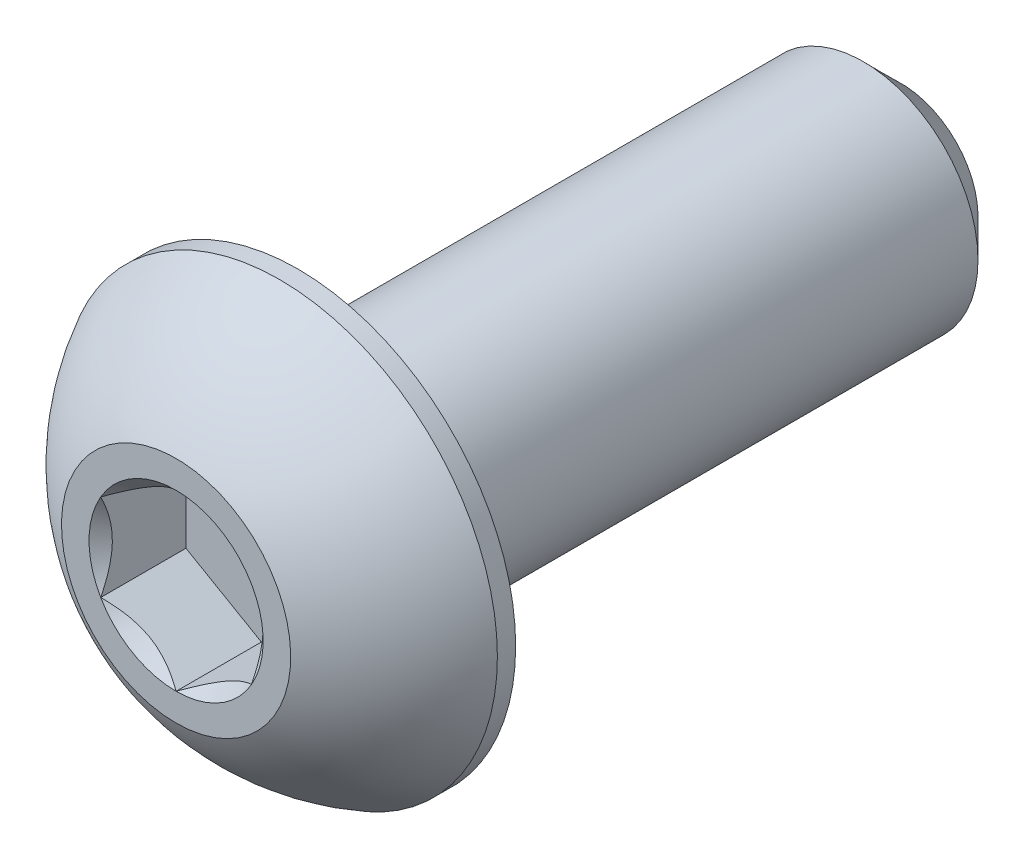
ISO-10303-21;
HEADER;
FILE_DESCRIPTION(('STEP AP214'),'2;1');
FILE_NAME('part.step','',(''),(''),'','','');
FILE_SCHEMA(('AUTOMOTIVE_DESIGN { 1 0 10303 214 1 1 1 1 }'));
ENDSEC;
DATA;
#1=APPLICATION_CONTEXT('core data for automotive mechanical design processes');
#2=APPLICATION_PROTOCOL_DEFINITION('international standard','automotive_design',2000,#1);
#3=PRODUCT_CONTEXT('',#1,'mechanical');
#4=PRODUCT('Part','Part','',(#3));
#5=PRODUCT_RELATED_PRODUCT_CATEGORY('part','',(#4));
#6=PRODUCT_DEFINITION_FORMATION('','',#4);
#7=PRODUCT_DEFINITION_CONTEXT('part definition',#1,'design');
#8=PRODUCT_DEFINITION('design','',#6,#7);
#9=PRODUCT_DEFINITION_SHAPE('','',#8);
#10=(LENGTH_UNIT() NAMED_UNIT(*) SI_UNIT(.MILLI.,.METRE.));
#11=(NAMED_UNIT(*) PLANE_ANGLE_UNIT() SI_UNIT($,.RADIAN.));
#12=(NAMED_UNIT(*) SI_UNIT($,.STERADIAN.) SOLID_ANGLE_UNIT());
#13=UNCERTAINTY_MEASURE_WITH_UNIT(LENGTH_MEASURE(1.E-05),#10,'distance_accuracy_value','');
#14=(GEOMETRIC_REPRESENTATION_CONTEXT(3) GLOBAL_UNCERTAINTY_ASSIGNED_CONTEXT((#13)) GLOBAL_UNIT_ASSIGNED_CONTEXT((#10,
#11,#12)) REPRESENTATION_CONTEXT('',''));
#15=CARTESIAN_POINT('',(0.,0.,0.));
#16=DIRECTION('',(0.,0.,1.));
#17=DIRECTION('',(1.,0.,0.));
#18=AXIS2_PLACEMENT_3D('',#15,#16,#17);
#19=CARTESIAN_POINT('',(0.,-2.41300000000001,-15.2654));
#20=DIRECTION('',(0.,0.,-1.));
#21=DIRECTION('',(0.,1.,0.));
#22=AXIS2_PLACEMENT_3D('',#19,#20,#21);
#23=PLANE('',#22);
#24=CARTESIAN_POINT('',(0.,0.,-15.2654));
#25=DIRECTION('',(0.,0.,-1.));
#26=DIRECTION('',(0.,1.,0.));
#27=AXIS2_PLACEMENT_3D('',#24,#25,#26);
#28=CIRCLE('',#27,1.61925000000001);
#29=CARTESIAN_POINT('',(0.,-1.61925000000001,-15.2654));
#30=VERTEX_POINT('',#29);
#31=EDGE_CURVE('E43',#30,#30,#28,.T.);
#32=ORIENTED_EDGE('',*,*,#31,.T.);
#33=EDGE_LOOP('',(#32));
#34=FACE_BOUND('',#33,.T.);
#35=ADVANCED_FACE('F35',(#34),#23,.T.);
#36=CARTESIAN_POINT('',(0.,0.,-15.2654));
#37=DIRECTION('',(0.,0.,-1.));
#38=DIRECTION('',(0.,1.,0.));
#39=AXIS2_PLACEMENT_3D('',#36,#37,#38);
#40=CYLINDRICAL_SURFACE('',#39,2.413);
#41=CARTESIAN_POINT('',(0.,0.,-14.47165));
#42=DIRECTION('',(0.,0.,-1.));
#43=DIRECTION('',(0.,1.,0.));
#44=AXIS2_PLACEMENT_3D('',#41,#42,#43);
#45=CIRCLE('',#44,2.413);
#46=CARTESIAN_POINT('',(0.,-2.41300000000001,-14.47165));
#47=VERTEX_POINT('',#46);
#48=EDGE_CURVE('E11',#47,#47,#45,.F.);
#49=ORIENTED_EDGE('',*,*,#48,.T.);
#50=EDGE_LOOP('',(#49));
#51=FACE_BOUND('',#50,.T.);
#52=CARTESIAN_POINT('',(0.,0.,-2.5654));
#53=DIRECTION('',(0.,0.,1.));
#54=DIRECTION('',(1.,0.,0.));
#55=AXIS2_PLACEMENT_3D('',#52,#53,#54);
#56=CIRCLE('',#55,2.413);
#57=CARTESIAN_POINT('',(2.413,0.,-2.5654));
#58=VERTEX_POINT('',#57);
#59=EDGE_CURVE('E169',#58,#58,#56,.F.);
#60=ORIENTED_EDGE('',*,*,#59,.T.);
#61=EDGE_LOOP('',(#60));
#62=FACE_BOUND('',#61,.T.);
#63=ADVANCED_FACE('F177',(#51,#62),#40,.T.);
#64=CARTESIAN_POINT('',(0.,0.,-15.2654));
#65=DIRECTION('',(0.,0.,1.));
#66=DIRECTION('',(0.,-1.,0.));
#67=AXIS2_PLACEMENT_3D('',#64,#65,#66);
#68=CONICAL_SURFACE('',#67,1.61925000000001,0.785398163397445);
#69=CARTESIAN_POINT('',(0.,-2.41300000000001,-14.47165));
#70=CARTESIAN_POINT('',(0.,-2.40473177083334,-14.4799182291667));
#71=CARTESIAN_POINT('',(0.,-2.39646354166667,-14.4881864583333));
#72=CARTESIAN_POINT('',(0.,-2.37992708333334,-14.5047229166667));
#73=CARTESIAN_POINT('',(0.,-2.37165885416667,-14.5129911458333));
#74=CARTESIAN_POINT('',(0.,-2.35512239583334,-14.5295276041667));
#75=CARTESIAN_POINT('',(0.,-2.34685416666667,-14.5377958333333));
#76=CARTESIAN_POINT('',(0.,-2.33031770833334,-14.5543322916667));
#77=CARTESIAN_POINT('',(0.,-2.32204947916667,-14.5626005208333));
#78=CARTESIAN_POINT('',(0.,-2.30551302083334,-14.5791369791667));
#79=CARTESIAN_POINT('',(0.,-2.29724479166667,-14.5874052083333));
#80=CARTESIAN_POINT('',(0.,-2.28070833333334,-14.6039416666667));
#81=CARTESIAN_POINT('',(0.,-2.27244010416667,-14.6122098958333));
#82=CARTESIAN_POINT('',(0.,-2.25590364583334,-14.6287463541667));
#83=CARTESIAN_POINT('',(0.,-2.24763541666667,-14.6370145833333));
#84=CARTESIAN_POINT('',(0.,-2.23109895833334,-14.6535510416667));
#85=CARTESIAN_POINT('',(0.,-2.22283072916667,-14.6618192708333));
#86=CARTESIAN_POINT('',(0.,-2.20629427083334,-14.6783557291667));
#87=CARTESIAN_POINT('',(0.,-2.19802604166667,-14.6866239583333));
#88=CARTESIAN_POINT('',(0.,-2.18148958333334,-14.7031604166667));
#89=CARTESIAN_POINT('',(0.,-2.17322135416667,-14.7114286458333));
#90=CARTESIAN_POINT('',(0.,-2.15668489583334,-14.7279651041667));
#91=CARTESIAN_POINT('',(0.,-2.14841666666667,-14.7362333333333));
#92=CARTESIAN_POINT('',(0.,-2.13188020833334,-14.7527697916667));
#93=CARTESIAN_POINT('',(0.,-2.12361197916667,-14.7610380208333));
#94=CARTESIAN_POINT('',(0.,-2.10707552083334,-14.7775744791667));
#95=CARTESIAN_POINT('',(0.,-2.09880729166667,-14.7858427083333));
#96=CARTESIAN_POINT('',(0.,-2.08227083333334,-14.8023791666667));
#97=CARTESIAN_POINT('',(0.,-2.07400260416667,-14.8106473958333));
#98=CARTESIAN_POINT('',(0.,-2.05746614583334,-14.8271838541667));
#99=CARTESIAN_POINT('',(0.,-2.04919791666667,-14.8354520833333));
#100=CARTESIAN_POINT('',(0.,-2.03266145833334,-14.8519885416667));
#101=CARTESIAN_POINT('',(0.,-2.02439322916667,-14.8602567708333));
#102=CARTESIAN_POINT('',(0.,-2.00785677083334,-14.8767932291667));
#103=CARTESIAN_POINT('',(0.,-1.99958854166668,-14.8850614583333));
#104=CARTESIAN_POINT('',(0.,-1.98305208333334,-14.9015979166667));
#105=CARTESIAN_POINT('',(0.,-1.97478385416667,-14.9098661458333));
#106=CARTESIAN_POINT('',(0.,-1.95824739583334,-14.9264026041667));
#107=CARTESIAN_POINT('',(0.,-1.94997916666668,-14.9346708333333));
#108=CARTESIAN_POINT('',(0.,-1.93344270833334,-14.9512072916667));
#109=CARTESIAN_POINT('',(0.,-1.92517447916668,-14.9594755208333));
#110=CARTESIAN_POINT('',(0.,-1.90863802083334,-14.9760119791667));
#111=CARTESIAN_POINT('',(0.,-1.90036979166668,-14.9842802083333));
#112=CARTESIAN_POINT('',(0.,-1.88383333333334,-15.0008166666667));
#113=CARTESIAN_POINT('',(0.,-1.87556510416668,-15.0090848958333));
#114=CARTESIAN_POINT('',(0.,-1.85902864583334,-15.0256213541667));
#115=CARTESIAN_POINT('',(0.,-1.85076041666668,-15.0338895833333));
#116=CARTESIAN_POINT('',(0.,-1.83422395833334,-15.0504260416667));
#117=CARTESIAN_POINT('',(0.,-1.82595572916668,-15.0586942708333));
#118=CARTESIAN_POINT('',(0.,-1.80941927083334,-15.0752307291667));
#119=CARTESIAN_POINT('',(0.,-1.80115104166668,-15.0834989583333));
#120=CARTESIAN_POINT('',(0.,-1.78461458333334,-15.1000354166667));
#121=CARTESIAN_POINT('',(0.,-1.77634635416668,-15.1083036458333));
#122=CARTESIAN_POINT('',(0.,-1.75980989583334,-15.1248401041667));
#123=CARTESIAN_POINT('',(0.,-1.75154166666668,-15.1331083333333));
#124=CARTESIAN_POINT('',(0.,-1.73500520833334,-15.1496447916667));
#125=CARTESIAN_POINT('',(0.,-1.72673697916668,-15.1579130208333));
#126=CARTESIAN_POINT('',(0.,-1.71020052083334,-15.1744494791667));
#127=CARTESIAN_POINT('',(0.,-1.70193229166668,-15.1827177083333));
#128=CARTESIAN_POINT('',(0.,-1.68539583333334,-15.1992541666667));
#129=CARTESIAN_POINT('',(0.,-1.67712760416668,-15.2075223958333));
#130=CARTESIAN_POINT('',(0.,-1.66059114583334,-15.2240588541667));
#131=CARTESIAN_POINT('',(0.,-1.65232291666668,-15.2323270833333));
#132=CARTESIAN_POINT('',(0.,-1.63578645833334,-15.2488635416667));
#133=CARTESIAN_POINT('',(0.,-1.62751822916668,-15.2571317708333));
#134=CARTESIAN_POINT('',(0.,-1.61925000000001,-15.2654));
#135=B_SPLINE_CURVE_WITH_KNOTS('',3,(#69,#70,#71,#72,#73,#74,#75,#76,#77,#78,#79,#80,#81,#82,
#83,#84,#85,#86,#87,#88,#89,#90,#91,#92,#93,#94,#95,#96,#97,#98,#99,#100,#101,#102,#103,#104,
#105,#106,#107,#108,#109,#110,#111,#112,#113,#114,#115,#116,#117,#118,#119,#120,#121,#122,#123,
#124,#125,#126,#127,#128,#129,#130,#131,#132,#133,#134),.UNSPECIFIED.,.F.,.F.,(4,2,2,2,2,2,2,2,
2,2,2,2,2,2,2,2,2,2,2,2,2,2,2,2,2,2,2,2,2,2,2,2,4),(0.,0.0350791254729259,0.0701582509458518,
0.105237376418779,0.140316501891705,0.175395627364631,0.210474752837558,0.245553878310484,
0.280633003783411,0.315712129256337,0.350791254729263,0.38587038020219,0.420949505675116,
0.456028631148042,0.491107756620969,0.526186882093895,0.561266007566822,0.596345133039748,
0.631424258512674,0.666503383985601,0.701582509458527,0.736661634931453,0.771740760404381,
0.806819885877306,0.841899011350234,0.87697813682316,0.912057262296086,0.947136387769013,
0.982215513241939,1.01729463871486,1.05237376418779,1.08745288966072,1.12253201513364),.UNSPECIFIED.);
#136=EDGE_CURVE('BSEAM37',#47,#30,#135,.T.);
#137=ORIENTED_EDGE('',*,*,#48,.F.);
#138=ORIENTED_EDGE('',*,*,#31,.F.);
#139=ORIENTED_EDGE('',*,*,#136,.T.);
#140=ORIENTED_EDGE('',*,*,#136,.F.);
#141=EDGE_LOOP('',(#137,#139,#138,#140));
#142=FACE_BOUND('',#141,.T.);
#143=ADVANCED_FACE('F37',(#142),#68,.T.);
#144=CARTESIAN_POINT('',(0.,0.,-4.5748806144438));
#145=DIRECTION('',(0.,0.,1.));
#146=DIRECTION('',(0.,-1.,0.));
#147=AXIS2_PLACEMENT_3D('',#144,#145,#146);
#148=SPHERICAL_SURFACE('',#147,5.17224338526463);
#149=CARTESIAN_POINT('',(0.,0.,0.));
#150=DIRECTION('',(0.,0.,1.));
#151=DIRECTION('',(1.,0.,0.));
#152=AXIS2_PLACEMENT_3D('',#149,#150,#151);
#153=CIRCLE('',#152,2.413);
#154=CARTESIAN_POINT('',(0.,-2.413,0.));
#155=VERTEX_POINT('',#154);
#156=EDGE_CURVE('E166',#155,#155,#153,.T.);
#157=CARTESIAN_POINT('',(0.,0.,-2.18059));
#158=DIRECTION('',(0.,0.,1.));
#159=DIRECTION('',(1.,0.,0.));
#160=AXIS2_PLACEMENT_3D('',#157,#158,#159);
#161=CIRCLE('',#160,4.5847);
#162=CARTESIAN_POINT('',(0.,-4.5847,-2.18059));
#163=VERTEX_POINT('',#162);
#164=EDGE_CURVE('E160',#163,#163,#161,.T.);
#165=CARTESIAN_POINT('',(0.,-2.413,0.));
#166=CARTESIAN_POINT('',(0.,-2.44179113663083,-0.0151857097788009));
#167=CARTESIAN_POINT('',(0.,-2.47043888331474,-0.0306432741933343));
#168=CARTESIAN_POINT('',(0.,-2.5274374690351,-0.0620964513369402));
#169=CARTESIAN_POINT('',(0.,-2.55578830807155,-0.0780920640660127));
#170=CARTESIAN_POINT('',(0.,-2.61218295074331,-0.110615676881771));
#171=CARTESIAN_POINT('',(0.,-2.64022675437863,-0.127143676968457));
#172=CARTESIAN_POINT('',(0.,-2.69599733629138,-0.160726162390165));
#173=CARTESIAN_POINT('',(0.,-2.72372411456882,-0.177780647725188));
#174=CARTESIAN_POINT('',(0.,-2.77885076121154,-0.21241002764294));
#175=CARTESIAN_POINT('',(0.,-2.80625062957682,-0.229984922225668));
#176=CARTESIAN_POINT('',(0.,-2.86071369040082,-0.265648855453746));
#177=CARTESIAN_POINT('',(0.,-2.88777688285954,-0.283737894099096));
#178=CARTESIAN_POINT('',(0.,-2.94155694533546,-0.320423667994127));
#179=CARTESIAN_POINT('',(0.,-2.96827381535265,-0.339020403243808));
#180=CARTESIAN_POINT('',(0.,-3.02135171000009,-0.37671494166065));
#181=CARTESIAN_POINT('',(0.,-3.04771273463033,-0.39581274482781));
#182=CARTESIAN_POINT('',(0.,-3.10006954235699,-0.434502611862808));
#183=CARTESIAN_POINT('',(0.,-3.12606532545341,-0.454094675730644));
#184=CARTESIAN_POINT('',(0.,-3.17768238416296,-0.493766080756604));
#185=CARTESIAN_POINT('',(0.,-3.20330365977609,-0.513845421914727));
#186=CARTESIAN_POINT('',(0.,-3.25416257105645,-0.554484224430573));
#187=CARTESIAN_POINT('',(0.,-3.27940020672367,-0.575043685788297));
#188=CARTESIAN_POINT('',(0.,-3.32948284239517,-0.616635400476975));
#189=CARTESIAN_POINT('',(0.,-3.35432784239946,-0.63766765380793));
#190=CARTESIAN_POINT('',(0.,-3.40361635097913,-0.680197455694829));
#191=CARTESIAN_POINT('',(0.,-3.42805985955453,-0.701695004250773));
#192=CARTESIAN_POINT('',(0.,-3.47653667261836,-0.745147733989217));
#193=CARTESIAN_POINT('',(0.,-3.5005699771068,-0.767102915171716));
#194=CARTESIAN_POINT('',(0.,-3.54821781555203,-0.81146308444603));
#195=CARTESIAN_POINT('',(0.,-3.57183234950881,-0.833868072537843));
#196=CARTESIAN_POINT('',(0.,-3.61863422971284,-0.879119869584105));
#197=CARTESIAN_POINT('',(0.,-3.64182157596008,-0.901966678538555));
#198=CARTESIAN_POINT('',(0.,-3.68776081583415,-0.948093973780533));
#199=CARTESIAN_POINT('',(0.,-3.71051270946098,-0.971374460068061));
#200=CARTESIAN_POINT('',(0.,-3.75557293439636,-1.01836081186645));
#201=CARTESIAN_POINT('',(0.,-3.7778812657049,-1.0420666773773));
#202=CARTESIAN_POINT('',(0.,-3.82204641440941,-1.08989533789018));
#203=CARTESIAN_POINT('',(0.,-3.84390323180538,-1.11401813289221));
#204=CARTESIAN_POINT('',(0.,-3.88715756202836,-1.16267205404467));
#205=CARTESIAN_POINT('',(0.,-3.90855507485536,-1.18720318019511));
#206=CARTESIAN_POINT('',(0.,-3.95088316899876,-1.23666501975588));
#207=CARTESIAN_POINT('',(0.,-3.97181375031515,-1.26159573316622));
#208=CARTESIAN_POINT('',(0.,-4.01320052092912,-1.31184786092909));
#209=CARTESIAN_POINT('',(0.,-4.03365671022669,-1.33716927528163));
#210=CARTESIAN_POINT('',(0.,-4.07408740538699,-1.38819377934977));
#211=CARTESIAN_POINT('',(0.,-4.09406191124973,-1.41389686906536));
#212=CARTESIAN_POINT('',(0.,-4.13352211981722,-1.46567556223513));
#213=CARTESIAN_POINT('',(0.,-4.15300782252198,-1.4917511656893));
#214=CARTESIAN_POINT('',(0.,-4.19148347927457,-1.54426559193551));
#215=CARTESIAN_POINT('',(0.,-4.2104734333224,-1.57070441472756));
#216=CARTESIAN_POINT('',(0.,-4.24795082398615,-1.6239358557723));
#217=CARTESIAN_POINT('',(0.,-4.26643826060207,-1.65072847402499));
#218=CARTESIAN_POINT('',(0.,-4.3029040266735,-1.70465795604563));
#219=CARTESIAN_POINT('',(0.,-4.32088235612901,-1.73179481981358));
#220=CARTESIAN_POINT('',(0.,-4.35632349988304,-1.78640312007115));
#221=CARTESIAN_POINT('',(0.,-4.37378631418156,-1.81387455656079));
#222=CARTESIAN_POINT('',(0.,-4.40819020238474,-1.86914221075438));
#223=CARTESIAN_POINT('',(0.,-4.42513127628939,-1.89693842845834));
#224=CARTESIAN_POINT('',(0.,-4.45848564813517,-1.95284573578717));
#225=CARTESIAN_POINT('',(0.,-4.4748989460763,-1.98095682541204));
#226=CARTESIAN_POINT('',(0.,-4.50719190474587,-2.03748386259807));
#227=CARTESIAN_POINT('',(0.,-4.5230715654743,-2.06589981015923));
#228=CARTESIAN_POINT('',(0.,-4.55429163018258,-2.12302641242262));
#229=CARTESIAN_POINT('',(0.,-4.56963203416241,-2.15173706712485));
#230=CARTESIAN_POINT('',(0.,-4.5847,-2.18059));
#231=B_SPLINE_CURVE_WITH_KNOTS('',3,(#165,#166,#167,#168,#169,#170,#171,#172,#173,#174,#175,
#176,#177,#178,#179,#180,#181,#182,#183,#184,#185,#186,#187,#188,#189,#190,#191,#192,#193,#194,
#195,#196,#197,#198,#199,#200,#201,#202,#203,#204,#205,#206,#207,#208,#209,#210,#211,#212,#213,
#214,#215,#216,#217,#218,#219,#220,#221,#222,#223,#224,#225,#226,#227,#228,#229,#230),
.UNSPECIFIED.,.F.,.F.,(4,2,2,2,2,2,2,2,2,2,2,2,2,2,2,2,2,2,2,2,2,2,2,2,2,2,2,2,2,2,2,2,4),(0.,
0.0976500604051489,0.195300120810298,0.292950181215447,0.390600241620598,0.488250302025747,
0.585900362430896,0.683550422836046,0.781200483241194,0.878850543646344,0.976500604051493,
1.07415066445664,1.17180072486179,1.26945078526694,1.36710084567209,1.46475090607724,
1.56240096648239,1.66005102688754,1.75770108729269,1.85535114769784,1.95300120810299,
2.05065126850814,2.14830132891329,2.24595138931843,2.34360144972358,2.44125151012873,
2.53890157053388,2.63655163093903,2.73420169134418,2.83185175174933,2.92950181215448,
3.02715187255963,3.12480193296478),.UNSPECIFIED.);
#232=EDGE_CURVE('BSEAM176',#155,#163,#231,.T.);
#233=ORIENTED_EDGE('',*,*,#156,.F.);
#234=ORIENTED_EDGE('',*,*,#164,.T.);
#235=ORIENTED_EDGE('',*,*,#232,.T.);
#236=ORIENTED_EDGE('',*,*,#232,.F.);
#237=EDGE_LOOP('',(#233,#235,#234,#236));
#238=FACE_BOUND('',#237,.T.);
#239=ADVANCED_FACE('F176',(#238),#148,.T.);
#240=CARTESIAN_POINT('',(0.,-2.413,0.));
#241=DIRECTION('',(0.,0.,-1.));
#242=DIRECTION('',(-1.,0.,0.));
#243=AXIS2_PLACEMENT_3D('',#240,#241,#242);
#244=PLANE('',#243);
#245=CARTESIAN_POINT('',(0.,0.,0.));
#246=DIRECTION('',(0.,0.,1.));
#247=DIRECTION('',(1.,0.,0.));
#248=AXIS2_PLACEMENT_3D('',#245,#246,#247);
#249=CIRCLE('',#248,1.83308710467706);
#250=CARTESIAN_POINT('',(-1.5875,0.916543552338531,0.));
#251=VERTEX_POINT('',#250);
#252=CARTESIAN_POINT('',(-1.5875,-0.916543552338532,0.));
#253=VERTEX_POINT('',#252);
#254=EDGE_CURVE('E56',#251,#253,#249,.T.);
#255=ORIENTED_EDGE('',*,*,#254,.F.);
#256=CARTESIAN_POINT('',(0.,1.83308710467706,0.));
#257=VERTEX_POINT('',#256);
#258=EDGE_CURVE('E130',#257,#251,#249,.T.);
#259=ORIENTED_EDGE('',*,*,#258,.F.);
#260=CARTESIAN_POINT('',(1.5875,0.916543552338531,0.));
#261=VERTEX_POINT('',#260);
#262=EDGE_CURVE('E107',#261,#257,#249,.T.);
#263=ORIENTED_EDGE('',*,*,#262,.F.);
#264=CARTESIAN_POINT('',(1.5875,-0.916543552338531,0.));
#265=VERTEX_POINT('',#264);
#266=EDGE_CURVE('E96',#265,#261,#249,.T.);
#267=ORIENTED_EDGE('',*,*,#266,.F.);
#268=CARTESIAN_POINT('',(0.,-1.83308710467706,0.));
#269=VERTEX_POINT('',#268);
#270=EDGE_CURVE('E88',#269,#265,#249,.T.);
#271=ORIENTED_EDGE('',*,*,#270,.F.);
#272=EDGE_CURVE('E49',#253,#269,#249,.T.);
#273=ORIENTED_EDGE('',*,*,#272,.F.);
#274=EDGE_LOOP('',(#255,#259,#263,#267,#271,#273));
#275=FACE_BOUND('',#274,.T.);
#276=ORIENTED_EDGE('',*,*,#156,.T.);
#277=EDGE_LOOP('',(#276));
#278=FACE_BOUND('',#277,.T.);
#279=ADVANCED_FACE('F127',(#275,#278),#244,.F.);
#280=CARTESIAN_POINT('',(0.,-4.5847,-2.5654));
#281=DIRECTION('',(0.,0.,1.));
#282=DIRECTION('',(1.,0.,0.));
#283=AXIS2_PLACEMENT_3D('',#280,#281,#282);
#284=PLANE('',#283);
#285=ORIENTED_EDGE('',*,*,#59,.F.);
#286=EDGE_LOOP('',(#285));
#287=FACE_BOUND('',#286,.T.);
#288=CARTESIAN_POINT('',(0.,0.,-2.5654));
#289=DIRECTION('',(0.,0.,1.));
#290=DIRECTION('',(1.,0.,0.));
#291=AXIS2_PLACEMENT_3D('',#288,#289,#290);
#292=CIRCLE('',#291,4.5847);
#293=CARTESIAN_POINT('',(4.5847,0.,-2.5654));
#294=VERTEX_POINT('',#293);
#295=EDGE_CURVE('E163',#294,#294,#292,.T.);
#296=ORIENTED_EDGE('',*,*,#295,.F.);
#297=EDGE_LOOP('',(#296));
#298=FACE_BOUND('',#297,.T.);
#299=ADVANCED_FACE('F194',(#287,#298),#284,.F.);
#300=CARTESIAN_POINT('',(0.,0.,0.));
#301=DIRECTION('',(0.,0.,1.));
#302=DIRECTION('',(1.,0.,0.));
#303=AXIS2_PLACEMENT_3D('',#300,#301,#302);
#304=CYLINDRICAL_SURFACE('',#303,4.5847);
#305=ORIENTED_EDGE('',*,*,#164,.F.);
#306=EDGE_LOOP('',(#305));
#307=FACE_BOUND('',#306,.T.);
#308=ORIENTED_EDGE('',*,*,#295,.T.);
#309=EDGE_LOOP('',(#308));
#310=FACE_BOUND('',#309,.T.);
#311=ADVANCED_FACE('F197',(#307,#310),#304,.T.);
#312=CARTESIAN_POINT('',(0.,0.,0.));
#313=DIRECTION('',(0.,0.,1.));
#314=DIRECTION('',(1.,0.,0.));
#315=AXIS2_PLACEMENT_3D('',#312,#313,#314);
#316=CONICAL_SURFACE('',#315,1.83308710467706,0.78539816339745);
#317=ORIENTED_EDGE('',*,*,#266,.T.);
#318=CARTESIAN_POINT('',(1.5875,-1.83163614232864,0.590762562254563));
#319=CARTESIAN_POINT('',(1.5875,-1.78705354844902,0.557077854803239));
#320=CARTESIAN_POINT('',(1.5875,-1.74222294150554,0.523722329968626));
#321=CARTESIAN_POINT('',(1.5875,-1.65196486784504,0.457805675888284));
#322=CARTESIAN_POINT('',(1.5875,-1.60653725449664,0.425244747634467));
#323=CARTESIAN_POINT('',(1.5875,-1.46854281940082,0.328493449461235));
#324=CARTESIAN_POINT('',(1.5875,-1.37494211623385,0.265753264612857));
#325=CARTESIAN_POINT('',(1.5875,-1.17864136265694,0.142553151294644));
#326=CARTESIAN_POINT('',(1.5875,-1.07572731596385,0.0824303289226483));
#327=CARTESIAN_POINT('',(1.5875,-0.864754189558117,-0.0275706334490083));
#328=CARTESIAN_POINT('',(1.5875,-0.756714033301438,-0.0774833149376717));
#329=CARTESIAN_POINT('',(1.5875,-0.594580029688666,-0.138547963751185));
#330=CARTESIAN_POINT('',(1.5875,-0.542894373932897,-0.156067797502568));
#331=CARTESIAN_POINT('',(1.5875,-0.43827206291756,-0.186958420156953));
#332=CARTESIAN_POINT('',(1.5875,-0.3853353220534,-0.200328924255393));
#333=CARTESIAN_POINT('',(1.5875,-0.279413400734369,-0.222002681044568));
#334=CARTESIAN_POINT('',(1.5875,-0.226446313904206,-0.230392976800141));
#335=CARTESIAN_POINT('',(1.5875,-0.119941637592404,-0.241941911012322));
#336=CARTESIAN_POINT('',(1.5875,-0.066404148626323,-0.245101456366562));
#337=CARTESIAN_POINT('',(1.5875,0.0387581192420282,-0.245952982965122));
#338=CARTESIAN_POINT('',(1.5875,0.0903813815542163,-0.243840334608509));
#339=CARTESIAN_POINT('',(1.5875,0.19318730201683,-0.234695846678065));
#340=CARTESIAN_POINT('',(1.5875,0.244369916988517,-0.227663530460197));
#341=CARTESIAN_POINT('',(1.5875,0.346790527788956,-0.208944949355169));
#342=CARTESIAN_POINT('',(1.5875,0.398013804172139,-0.197179358640977));
#343=CARTESIAN_POINT('',(1.5875,0.499340680307277,-0.169620657149212));
#344=CARTESIAN_POINT('',(1.5875,0.549444372105894,-0.153827878801824));
#345=CARTESIAN_POINT('',(1.5875,0.707022639586408,-0.0982133790717419));
#346=CARTESIAN_POINT('',(1.5875,0.812258737570578,-0.0520647672653369));
#347=CARTESIAN_POINT('',(1.5875,1.01778869013701,0.0505458403808824));
#348=CARTESIAN_POINT('',(1.5875,1.11806310933257,0.107044855107553));
#349=CARTESIAN_POINT('',(1.5875,1.30970442577157,0.223612502972616));
#350=CARTESIAN_POINT('',(1.5875,1.40126637149297,0.283364441978613));
#351=CARTESIAN_POINT('',(1.5875,1.53616443073865,0.37573700869171));
#352=CARTESIAN_POINT('',(1.5875,1.58054835823549,0.406854014274728));
#353=CARTESIAN_POINT('',(1.5875,1.66870952512132,0.469911550181166));
#354=CARTESIAN_POINT('',(1.5875,1.71248692801697,0.501851851647461));
#355=CARTESIAN_POINT('',(1.5875,1.75601179240957,0.53413355784713));
#356=B_SPLINE_CURVE_WITH_KNOTS('',3,(#318,#319,#320,#321,#322,#323,#324,#325,#326,#327,#328,
#329,#330,#331,#332,#333,#334,#335,#336,#337,#338,#339,#340,#341,#342,#343,#344,#345,#346,#347,
#348,#349,#350,#351,#352,#353,#354,#355),.UNSPECIFIED.,.F.,.F.,(4,2,2,2,2,2,2,2,2,2,2,2,2,2,2,2,
2,2,4),(0.,0.167627505127548,0.335296980846479,0.673194674702937,1.0304700708717,
1.38651603079307,1.55010049300857,1.71369618096554,1.87434127467533,2.034958513124,
2.18971280484453,2.34448209207484,2.50196108385089,2.65942708049529,3.00314617711216,
3.34811949873714,3.67595792169729,3.83856722085481,4.00113179576279),.UNSPECIFIED.);
#357=EDGE_CURVE('E101',#265,#261,#356,.T.);
#358=ORIENTED_EDGE('',*,*,#357,.F.);
#359=EDGE_LOOP('',(#317,#358));
#360=FACE_BOUND('',#359,.T.);
#361=ADVANCED_FACE('F102',(#360),#316,.F.);
#362=ORIENTED_EDGE('',*,*,#262,.T.);
#363=CARTESIAN_POINT('',(1.5877,0.916428082284693,0.000115480963706747));
#364=CARTESIAN_POINT('',(1.53312479190086,0.947937093371809,-0.0313691916294031));
#365=CARTESIAN_POINT('',(1.47763696320971,0.979973006203395,-0.06100495398647));
#366=CARTESIAN_POINT('',(1.36449087915364,1.04529792829092,-0.115267739979175));
#367=CARTESIAN_POINT('',(1.30682185887062,1.07859315267522,-0.139864564866823));
#368=CARTESIAN_POINT('',(1.1905349781269,1.14573141457583,-0.181999635727418));
#369=CARTESIAN_POINT('',(1.13194674474407,1.17955734689075,-0.199643807270178));
#370=CARTESIAN_POINT('',(1.01348022674557,1.24795402294714,-0.226828529915031));
#371=CARTESIAN_POINT('',(0.953605562983895,1.28252267618758,-0.236389379304923));
#372=CARTESIAN_POINT('',(0.850418771876558,1.34209759781022,-0.245015586895992));
#373=CARTESIAN_POINT('',(0.807240015952288,1.36702686416637,-0.246292807190424));
#374=CARTESIAN_POINT('',(0.720953038535399,1.41684467380557,-0.244142944185295));
#375=CARTESIAN_POINT('',(0.677844847078612,1.44173319974742,-0.240714211450657));
#376=CARTESIAN_POINT('',(0.592046335002031,1.49126899379091,-0.229349005566657));
#377=CARTESIAN_POINT('',(0.549356408925407,1.51591603410293,-0.221408628198358));
#378=CARTESIAN_POINT('',(0.464693063478359,1.56479643938728,-0.201451585548899));
#379=CARTESIAN_POINT('',(0.422719959755075,1.58902962212064,-0.189433170791309));
#380=CARTESIAN_POINT('',(0.315211458113567,1.65109968448354,-0.153753102752754));
#381=CARTESIAN_POINT('',(0.2503427717089,1.68855163804125,-0.127401427696863));
#382=CARTESIAN_POINT('',(0.154961599380924,1.74361998356043,-0.082916463148298));
#383=CARTESIAN_POINT('',(0.123530699536157,1.76176662204668,-0.0672871421988685));
#384=CARTESIAN_POINT('',(0.0612469855696369,1.79772614107138,-0.0346015121388986));
#385=CARTESIAN_POINT('',(0.0303939039605764,1.8155391760437,-0.0175458843430301));
#386=CARTESIAN_POINT('',(-0.000200000000000335,1.8332025747309,0.000115480963706747));
#387=B_SPLINE_CURVE_WITH_KNOTS('',3,(#363,#364,#365,#366,#367,#368,#369,#370,#371,#372,#373,
#374,#375,#376,#377,#378,#379,#380,#381,#382,#383,#384,#385,#386),.UNSPECIFIED.,.F.,.F.,(4,2,2,
2,2,2,2,2,2,2,2,4),(0.,0.211482650810816,0.424197870807276,0.633533884524815,0.842342653263347,
0.99175555372714,1.14122083674204,1.29081565918877,1.44047473906437,1.6781878086972,
1.79671410024894,1.91518409436631),.UNSPECIFIED.);
#388=EDGE_CURVE('E106',#261,#257,#387,.T.);
#389=ORIENTED_EDGE('',*,*,#388,.F.);
#390=EDGE_LOOP('',(#362,#389));
#391=FACE_BOUND('',#390,.T.);
#392=ADVANCED_FACE('F288',(#391),#316,.F.);
#393=ORIENTED_EDGE('',*,*,#258,.T.);
#394=CARTESIAN_POINT('',(0.000199999999999625,1.8332025747309,0.000115480963706835));
#395=CARTESIAN_POINT('',(-0.0543752080991368,1.80169356364378,-0.0313691916294032));
#396=CARTESIAN_POINT('',(-0.10986303679029,1.7696576508122,-0.0610049539864701));
#397=CARTESIAN_POINT('',(-0.223009120846359,1.70433272872467,-0.115267739979175));
#398=CARTESIAN_POINT('',(-0.280678141129381,1.67103750434037,-0.139864564866824));
#399=CARTESIAN_POINT('',(-0.396965021873104,1.60389924243976,-0.181999635727418));
#400=CARTESIAN_POINT('',(-0.455553255255932,1.57007331012484,-0.199643807270178));
#401=CARTESIAN_POINT('',(-0.574019773254431,1.50167663406845,-0.226828529915031));
#402=CARTESIAN_POINT('',(-0.633894437016106,1.46710798082801,-0.236389379304923));
#403=CARTESIAN_POINT('',(-0.737081228123443,1.40753305920537,-0.245015586895992));
#404=CARTESIAN_POINT('',(-0.780259984047713,1.38260379284922,-0.246292807190424));
#405=CARTESIAN_POINT('',(-0.866546961464602,1.33278598321002,-0.244142944185296));
#406=CARTESIAN_POINT('',(-0.909655152921389,1.30789745726817,-0.240714211450657));
#407=CARTESIAN_POINT('',(-0.99545366499797,1.25836166322468,-0.229349005566656));
#408=CARTESIAN_POINT('',(-1.03814359107459,1.23371462291266,-0.221408628198358));
#409=CARTESIAN_POINT('',(-1.12280693652164,1.18483421762831,-0.201451585548899));
#410=CARTESIAN_POINT('',(-1.16478004024493,1.16060103489495,-0.189433170791309));
#411=CARTESIAN_POINT('',(-1.27228854188643,1.09853097253205,-0.153753102752754));
#412=CARTESIAN_POINT('',(-1.3371572282911,1.06107901897434,-0.127401427696863));
#413=CARTESIAN_POINT('',(-1.43253840061908,1.00601067345516,-0.0829164631482982));
#414=CARTESIAN_POINT('',(-1.46396930046384,0.987864034968913,-0.0672871421988688));
#415=CARTESIAN_POINT('',(-1.52625301443036,0.951904515944214,-0.0346015121388989));
#416=CARTESIAN_POINT('',(-1.55710609603942,0.934091480971893,-0.0175458843430305));
#417=CARTESIAN_POINT('',(-1.5877,0.916428082284693,0.000115480963706338));
#418=B_SPLINE_CURVE_WITH_KNOTS('',3,(#394,#395,#396,#397,#398,#399,#400,#401,#402,#403,#404,
#405,#406,#407,#408,#409,#410,#411,#412,#413,#414,#415,#416,#417),.UNSPECIFIED.,.F.,.F.,(4,2,2,
2,2,2,2,2,2,2,2,4),(0.,0.211482650810816,0.424197870807276,0.633533884524816,0.842342653263349,
0.991755553727142,1.14122083674205,1.29081565918877,1.44047473906438,1.6781878086972,
1.79671410024894,1.91518409436631),.UNSPECIFIED.);
#419=EDGE_CURVE('E137',#257,#251,#418,.T.);
#420=ORIENTED_EDGE('',*,*,#419,.F.);
#421=EDGE_LOOP('',(#393,#420));
#422=FACE_BOUND('',#421,.T.);
#423=ADVANCED_FACE('F135',(#422),#316,.F.);
#424=ORIENTED_EDGE('',*,*,#254,.T.);
#425=CARTESIAN_POINT('',(-1.5875,-1.83163614232865,0.590762562254564));
#426=CARTESIAN_POINT('',(-1.5875,-1.78705354844902,0.55707785480324));
#427=CARTESIAN_POINT('',(-1.5875,-1.74222294150555,0.523722329968627));
#428=CARTESIAN_POINT('',(-1.5875,-1.65196486784504,0.457805675888285));
#429=CARTESIAN_POINT('',(-1.5875,-1.60653725449665,0.425244747634468));
#430=CARTESIAN_POINT('',(-1.5875,-1.46854281940082,0.328493449461235));
#431=CARTESIAN_POINT('',(-1.5875,-1.37494211623386,0.265753264612857));
#432=CARTESIAN_POINT('',(-1.5875,-1.17864136265695,0.142553151294644));
#433=CARTESIAN_POINT('',(-1.5875,-1.07572731596385,0.0824303289226481));
#434=CARTESIAN_POINT('',(-1.5875,-0.864754189558117,-0.0275706334490085));
#435=CARTESIAN_POINT('',(-1.5875,-0.756714033301438,-0.0774833149376719));
#436=CARTESIAN_POINT('',(-1.5875,-0.594580029688666,-0.138547963751186));
#437=CARTESIAN_POINT('',(-1.5875,-0.542894373932898,-0.156067797502569));
#438=CARTESIAN_POINT('',(-1.5875,-0.43827206291756,-0.186958420156954));
#439=CARTESIAN_POINT('',(-1.5875,-0.3853353220534,-0.200328924255393));
#440=CARTESIAN_POINT('',(-1.5875,-0.27941340073437,-0.222002681044568));
#441=CARTESIAN_POINT('',(-1.5875,-0.226446313904207,-0.230392976800141));
#442=CARTESIAN_POINT('',(-1.5875,-0.119941637592404,-0.241941911012323));
#443=CARTESIAN_POINT('',(-1.5875,-0.0664041486263238,-0.245101456366563));
#444=CARTESIAN_POINT('',(-1.5875,0.0387581192420274,-0.245952982965122));
#445=CARTESIAN_POINT('',(-1.5875,0.0903813815542155,-0.24384033460851));
#446=CARTESIAN_POINT('',(-1.5875,0.193187302016829,-0.234695846678065));
#447=CARTESIAN_POINT('',(-1.5875,0.244369916988516,-0.227663530460198));
#448=CARTESIAN_POINT('',(-1.5875,0.346790527788956,-0.208944949355169));
#449=CARTESIAN_POINT('',(-1.5875,0.398013804172139,-0.197179358640978));
#450=CARTESIAN_POINT('',(-1.5875,0.499340680307276,-0.169620657149213));
#451=CARTESIAN_POINT('',(-1.5875,0.549444372105894,-0.153827878801825));
#452=CARTESIAN_POINT('',(-1.5875,0.707022639586407,-0.0982133790717423));
#453=CARTESIAN_POINT('',(-1.5875,0.812258737570578,-0.0520647672653373));
#454=CARTESIAN_POINT('',(-1.5875,1.01778869013701,0.0505458403808818));
#455=CARTESIAN_POINT('',(-1.5875,1.11806310933256,0.107044855107552));
#456=CARTESIAN_POINT('',(-1.5875,1.30970442577157,0.223612502972616));
#457=CARTESIAN_POINT('',(-1.5875,1.40126637149297,0.283364441978612));
#458=CARTESIAN_POINT('',(-1.5875,1.53616443073864,0.375737008691709));
#459=CARTESIAN_POINT('',(-1.5875,1.58054835823549,0.406854014274728));
#460=CARTESIAN_POINT('',(-1.5875,1.66870952512132,0.469911550181165));
#461=CARTESIAN_POINT('',(-1.5875,1.71248692801697,0.501851851647461));
#462=CARTESIAN_POINT('',(-1.5875,1.75601179240957,0.53413355784713));
#463=B_SPLINE_CURVE_WITH_KNOTS('',3,(#425,#426,#427,#428,#429,#430,#431,#432,#433,#434,#435,
#436,#437,#438,#439,#440,#441,#442,#443,#444,#445,#446,#447,#448,#449,#450,#451,#452,#453,#454,
#455,#456,#457,#458,#459,#460,#461,#462),.UNSPECIFIED.,.F.,.F.,(4,2,2,2,2,2,2,2,2,2,2,2,2,2,2,2,
2,2,4),(0.,0.167627505127548,0.33529698084648,0.673194674702938,1.0304700708717,
1.38651603079307,1.55010049300858,1.71369618096554,1.87434127467533,2.034958513124,
2.18971280484453,2.34448209207484,2.50196108385089,2.65942708049529,3.00314617711216,
3.34811949873714,3.6759579216973,3.83856722085481,4.00113179576279),.UNSPECIFIED.);
#464=EDGE_CURVE('E141',#251,#253,#463,.F.);
#465=ORIENTED_EDGE('',*,*,#464,.F.);
#466=EDGE_LOOP('',(#424,#465));
#467=FACE_BOUND('',#466,.T.);
#468=ADVANCED_FACE('F282',(#467),#316,.F.);
#469=ORIENTED_EDGE('',*,*,#272,.T.);
#470=CARTESIAN_POINT('',(-1.5877,-0.916428082284693,0.000115480963706314));
#471=CARTESIAN_POINT('',(-1.53312479190086,-0.947937093371809,-0.0313691916294034));
#472=CARTESIAN_POINT('',(-1.47763696320971,-0.979973006203395,-0.0610049539864703));
#473=CARTESIAN_POINT('',(-1.36449087915364,-1.04529792829092,-0.115267739979175));
#474=CARTESIAN_POINT('',(-1.30682185887062,-1.07859315267522,-0.139864564866824));
#475=CARTESIAN_POINT('',(-1.1905349781269,-1.14573141457583,-0.181999635727418));
#476=CARTESIAN_POINT('',(-1.13194674474407,-1.17955734689075,-0.199643807270178));
#477=CARTESIAN_POINT('',(-1.01348022674557,-1.24795402294714,-0.226828529915031));
#478=CARTESIAN_POINT('',(-0.953605562983895,-1.28252267618758,-0.236389379304923));
#479=CARTESIAN_POINT('',(-0.850418771876557,-1.34209759781022,-0.245015586895992));
#480=CARTESIAN_POINT('',(-0.807240015952288,-1.36702686416637,-0.246292807190424));
#481=CARTESIAN_POINT('',(-0.720953038535399,-1.41684467380557,-0.244142944185296));
#482=CARTESIAN_POINT('',(-0.677844847078612,-1.44173319974742,-0.240714211450657));
#483=CARTESIAN_POINT('',(-0.592046335002031,-1.49126899379091,-0.229349005566657));
#484=CARTESIAN_POINT('',(-0.549356408925406,-1.51591603410293,-0.221408628198358));
#485=CARTESIAN_POINT('',(-0.464693063478359,-1.56479643938728,-0.201451585548899));
#486=CARTESIAN_POINT('',(-0.422719959755075,-1.58902962212064,-0.189433170791309));
#487=CARTESIAN_POINT('',(-0.315211458113566,-1.65109968448354,-0.153753102752754));
#488=CARTESIAN_POINT('',(-0.2503427717089,-1.68855163804125,-0.127401427696864));
#489=CARTESIAN_POINT('',(-0.154961599380924,-1.74361998356043,-0.0829164631482981));
#490=CARTESIAN_POINT('',(-0.123530699536157,-1.76176662204668,-0.0672871421988687));
#491=CARTESIAN_POINT('',(-0.0612469855696368,-1.79772614107138,-0.0346015121388988));
#492=CARTESIAN_POINT('',(-0.0303939039605762,-1.8155391760437,-0.0175458843430303));
#493=CARTESIAN_POINT('',(0.000200000000000577,-1.8332025747309,0.000115480963706654));
#494=B_SPLINE_CURVE_WITH_KNOTS('',3,(#470,#471,#472,#473,#474,#475,#476,#477,#478,#479,#480,
#481,#482,#483,#484,#485,#486,#487,#488,#489,#490,#491,#492,#493),.UNSPECIFIED.,.F.,.F.,(4,2,2,
2,2,2,2,2,2,2,2,4),(0.,0.211482650810816,0.424197870807276,0.633533884524815,0.842342653263347,
0.99175555372714,1.14122083674204,1.29081565918877,1.44047473906437,1.6781878086972,
1.79671410024894,1.91518409436631),.UNSPECIFIED.);
#495=EDGE_CURVE('E117',#253,#269,#494,.T.);
#496=ORIENTED_EDGE('',*,*,#495,.F.);
#497=EDGE_LOOP('',(#469,#496));
#498=FACE_BOUND('',#497,.T.);
#499=ADVANCED_FACE('F226',(#498),#316,.F.);
#500=ORIENTED_EDGE('',*,*,#270,.T.);
#501=CARTESIAN_POINT('',(-0.000199999999999235,-1.8332025747309,0.000115480963706835));
#502=CARTESIAN_POINT('',(0.0543752080991371,-1.80169356364378,-0.0313691916294032));
#503=CARTESIAN_POINT('',(0.109863036790291,-1.7696576508122,-0.0610049539864701));
#504=CARTESIAN_POINT('',(0.223009120846359,-1.70433272872467,-0.115267739979175));
#505=CARTESIAN_POINT('',(0.280678141129382,-1.67103750434037,-0.139864564866824));
#506=CARTESIAN_POINT('',(0.396965021873104,-1.60389924243976,-0.181999635727418));
#507=CARTESIAN_POINT('',(0.455553255255931,-1.57007331012484,-0.199643807270178));
#508=CARTESIAN_POINT('',(0.574019773254431,-1.50167663406845,-0.226828529915031));
#509=CARTESIAN_POINT('',(0.633894437016105,-1.46710798082801,-0.236389379304923));
#510=CARTESIAN_POINT('',(0.737081228123443,-1.40753305920537,-0.245015586895992));
#511=CARTESIAN_POINT('',(0.780259984047712,-1.38260379284922,-0.246292807190424));
#512=CARTESIAN_POINT('',(0.866546961464601,-1.33278598321002,-0.244142944185295));
#513=CARTESIAN_POINT('',(0.909655152921388,-1.30789745726817,-0.240714211450657));
#514=CARTESIAN_POINT('',(0.995453664997969,-1.25836166322468,-0.229349005566657));
#515=CARTESIAN_POINT('',(1.03814359107459,-1.23371462291266,-0.221408628198358));
#516=CARTESIAN_POINT('',(1.12280693652164,-1.18483421762831,-0.201451585548899));
#517=CARTESIAN_POINT('',(1.16478004024493,-1.16060103489495,-0.189433170791309));
#518=CARTESIAN_POINT('',(1.27228854188643,-1.09853097253205,-0.153753102752754));
#519=CARTESIAN_POINT('',(1.3371572282911,-1.06107901897434,-0.127401427696864));
#520=CARTESIAN_POINT('',(1.43253840061908,-1.00601067345516,-0.0829164631482982));
#521=CARTESIAN_POINT('',(1.46396930046384,-0.987864034968913,-0.0672871421988686));
#522=CARTESIAN_POINT('',(1.52625301443036,-0.951904515944214,-0.0346015121388986));
#523=CARTESIAN_POINT('',(1.55710609603942,-0.934091480971893,-0.0175458843430301));
#524=CARTESIAN_POINT('',(1.5877,-0.916428082284692,0.000115480963706545));
#525=B_SPLINE_CURVE_WITH_KNOTS('',3,(#501,#502,#503,#504,#505,#506,#507,#508,#509,#510,#511,
#512,#513,#514,#515,#516,#517,#518,#519,#520,#521,#522,#523,#524),.UNSPECIFIED.,.F.,.F.,(4,2,2,
2,2,2,2,2,2,2,2,4),(0.,0.211482650810817,0.424197870807276,0.633533884524815,0.842342653263348,
0.991755553727141,1.14122083674204,1.29081565918877,1.44047473906437,1.6781878086972,
1.79671410024894,1.91518409436631),.UNSPECIFIED.);
#526=EDGE_CURVE('E92',#269,#265,#525,.T.);
#527=ORIENTED_EDGE('',*,*,#526,.F.);
#528=EDGE_LOOP('',(#500,#527));
#529=FACE_BOUND('',#528,.T.);
#530=ADVANCED_FACE('F90',(#529),#316,.F.);
#531=CARTESIAN_POINT('',(1.5875,-0.91654355233853,-1.79578));
#532=DIRECTION('',(0.,0.,1.));
#533=DIRECTION('',(1.,0.,0.));
#534=AXIS2_PLACEMENT_3D('',#531,#532,#533);
#535=PLANE('',#534);
#536=DIRECTION('',(0.866025403784438,0.5,0.));
#537=VECTOR('',#536,1.);
#538=CARTESIAN_POINT('',(0.,-1.83308710467706,-1.79578));
#539=LINE('',#538,#537);
#540=CARTESIAN_POINT('',(0.,-1.83308710467706,-1.79578));
#541=VERTEX_POINT('',#540);
#542=CARTESIAN_POINT('',(1.5875,-0.91654355233853,-1.79578));
#543=VERTEX_POINT('',#542);
#544=EDGE_CURVE('E116',#541,#543,#539,.T.);
#545=ORIENTED_EDGE('',*,*,#544,.T.);
#546=DIRECTION('',(0.,1.,0.));
#547=VECTOR('',#546,1.);
#548=CARTESIAN_POINT('',(1.5875,-0.91654355233853,-1.79578));
#549=LINE('',#548,#547);
#550=CARTESIAN_POINT('',(1.5875,0.916543552338531,-1.79578));
#551=VERTEX_POINT('',#550);
#552=EDGE_CURVE('E121',#543,#551,#549,.T.);
#553=ORIENTED_EDGE('',*,*,#552,.T.);
#554=DIRECTION('',(-0.866025403784439,0.5,0.));
#555=VECTOR('',#554,1.);
#556=CARTESIAN_POINT('',(1.5875,0.916543552338531,-1.79578));
#557=LINE('',#556,#555);
#558=CARTESIAN_POINT('',(0.,1.83308710467706,-1.79578));
#559=VERTEX_POINT('',#558);
#560=EDGE_CURVE('E272',#551,#559,#557,.T.);
#561=ORIENTED_EDGE('',*,*,#560,.T.);
#562=DIRECTION('',(-0.866025403784439,-0.5,0.));
#563=VECTOR('',#562,1.);
#564=CARTESIAN_POINT('',(0.,1.83308710467706,-1.79578));
#565=LINE('',#564,#563);
#566=CARTESIAN_POINT('',(-1.5875,0.916543552338531,-1.79578));
#567=VERTEX_POINT('',#566);
#568=EDGE_CURVE('E151',#559,#567,#565,.T.);
#569=ORIENTED_EDGE('',*,*,#568,.T.);
#570=DIRECTION('',(0.,-1.,0.));
#571=VECTOR('',#570,1.);
#572=CARTESIAN_POINT('',(-1.5875,0.916543552338531,-1.79578));
#573=LINE('',#572,#571);
#574=CARTESIAN_POINT('',(-1.5875,-0.916543552338531,-1.79578));
#575=VERTEX_POINT('',#574);
#576=EDGE_CURVE('E276',#567,#575,#573,.T.);
#577=ORIENTED_EDGE('',*,*,#576,.T.);
#578=DIRECTION('',(0.866025403784439,-0.5,0.));
#579=VECTOR('',#578,1.);
#580=CARTESIAN_POINT('',(-1.5875,-0.916543552338531,-1.79578));
#581=LINE('',#580,#579);
#582=EDGE_CURVE('E124',#575,#541,#581,.T.);
#583=ORIENTED_EDGE('',*,*,#582,.T.);
#584=EDGE_LOOP('',(#545,#553,#561,#569,#577,#583));
#585=FACE_BOUND('',#584,.T.);
#586=ADVANCED_FACE('F225',(#585),#535,.T.);
#587=CARTESIAN_POINT('',(1.5875,-0.91654355233853,-1.79578));
#588=DIRECTION('',(1.,0.,0.));
#589=DIRECTION('',(0.,0.,-1.));
#590=AXIS2_PLACEMENT_3D('',#587,#588,#589);
#591=PLANE('',#590);
#592=DIRECTION('',(0.,0.,1.));
#593=VECTOR('',#592,1.);
#594=CARTESIAN_POINT('',(1.5875,-0.91654355233853,-1.79578));
#595=LINE('',#594,#593);
#596=EDGE_CURVE('E113',#543,#265,#595,.T.);
#597=ORIENTED_EDGE('',*,*,#596,.T.);
#598=ORIENTED_EDGE('',*,*,#357,.T.);
#599=DIRECTION('',(0.,0.,1.));
#600=VECTOR('',#599,1.);
#601=CARTESIAN_POINT('',(1.5875,0.916543552338531,-1.79578));
#602=LINE('',#601,#600);
#603=EDGE_CURVE('E123',#551,#261,#602,.T.);
#604=ORIENTED_EDGE('',*,*,#603,.F.);
#605=ORIENTED_EDGE('',*,*,#552,.F.);
#606=EDGE_LOOP('',(#597,#598,#604,#605));
#607=FACE_BOUND('',#606,.T.);
#608=ADVANCED_FACE('F119',(#607),#591,.F.);
#609=CARTESIAN_POINT('',(1.5875,0.916543552338531,-1.79578));
#610=DIRECTION('',(0.5,0.866025403784439,0.));
#611=DIRECTION('',(-0.866025403784439,0.5,0.));
#612=AXIS2_PLACEMENT_3D('',#609,#610,#611);
#613=PLANE('',#612);
#614=ORIENTED_EDGE('',*,*,#603,.T.);
#615=ORIENTED_EDGE('',*,*,#388,.T.);
#616=DIRECTION('',(0.,0.,1.));
#617=VECTOR('',#616,1.);
#618=CARTESIAN_POINT('',(0.,1.83308710467706,-1.79578));
#619=LINE('',#618,#617);
#620=EDGE_CURVE('E146',#559,#257,#619,.T.);
#621=ORIENTED_EDGE('',*,*,#620,.F.);
#622=ORIENTED_EDGE('',*,*,#560,.F.);
#623=EDGE_LOOP('',(#614,#615,#621,#622));
#624=FACE_BOUND('',#623,.T.);
#625=ADVANCED_FACE('F144',(#624),#613,.F.);
#626=CARTESIAN_POINT('',(0.,1.83308710467706,-1.79578));
#627=DIRECTION('',(-0.5,0.866025403784438,0.));
#628=DIRECTION('',(-0.866025403784438,-0.5,0.));
#629=AXIS2_PLACEMENT_3D('',#626,#627,#628);
#630=PLANE('',#629);
#631=ORIENTED_EDGE('',*,*,#620,.T.);
#632=ORIENTED_EDGE('',*,*,#419,.T.);
#633=DIRECTION('',(0.,0.,1.));
#634=VECTOR('',#633,1.);
#635=CARTESIAN_POINT('',(-1.5875,0.916543552338531,-1.79578));
#636=LINE('',#635,#634);
#637=EDGE_CURVE('E153',#567,#251,#636,.T.);
#638=ORIENTED_EDGE('',*,*,#637,.F.);
#639=ORIENTED_EDGE('',*,*,#568,.F.);
#640=EDGE_LOOP('',(#631,#632,#638,#639));
#641=FACE_BOUND('',#640,.T.);
#642=ADVANCED_FACE('F149',(#641),#630,.F.);
#643=CARTESIAN_POINT('',(-1.5875,0.916543552338531,-1.79578));
#644=DIRECTION('',(-1.,0.,0.));
#645=DIRECTION('',(0.,-1.,0.));
#646=AXIS2_PLACEMENT_3D('',#643,#644,#645);
#647=PLANE('',#646);
#648=ORIENTED_EDGE('',*,*,#637,.T.);
#649=ORIENTED_EDGE('',*,*,#464,.T.);
#650=DIRECTION('',(0.,0.,1.));
#651=VECTOR('',#650,1.);
#652=CARTESIAN_POINT('',(-1.5875,-0.916543552338531,-1.79578));
#653=LINE('',#652,#651);
#654=EDGE_CURVE('E155',#575,#253,#653,.T.);
#655=ORIENTED_EDGE('',*,*,#654,.F.);
#656=ORIENTED_EDGE('',*,*,#576,.F.);
#657=EDGE_LOOP('',(#648,#649,#655,#656));
#658=FACE_BOUND('',#657,.T.);
#659=ADVANCED_FACE('F251',(#658),#647,.F.);
#660=CARTESIAN_POINT('',(-1.5875,-0.916543552338531,-1.79578));
#661=DIRECTION('',(-0.5,-0.866025403784439,0.));
#662=DIRECTION('',(0.866025403784439,-0.5,0.));
#663=AXIS2_PLACEMENT_3D('',#660,#661,#662);
#664=PLANE('',#663);
#665=ORIENTED_EDGE('',*,*,#654,.T.);
#666=ORIENTED_EDGE('',*,*,#495,.T.);
#667=DIRECTION('',(0.,0.,1.));
#668=VECTOR('',#667,1.);
#669=CARTESIAN_POINT('',(0.,-1.83308710467706,-1.79578));
#670=LINE('',#669,#668);
#671=EDGE_CURVE('E115',#541,#269,#670,.T.);
#672=ORIENTED_EDGE('',*,*,#671,.F.);
#673=ORIENTED_EDGE('',*,*,#582,.F.);
#674=EDGE_LOOP('',(#665,#666,#672,#673));
#675=FACE_BOUND('',#674,.T.);
#676=ADVANCED_FACE('F205',(#675),#664,.F.);
#677=CARTESIAN_POINT('',(0.,-1.83308710467706,-1.79578));
#678=DIRECTION('',(0.5,-0.866025403784439,0.));
#679=DIRECTION('',(0.866025403784438,0.5,0.));
#680=AXIS2_PLACEMENT_3D('',#677,#678,#679);
#681=PLANE('',#680);
#682=ORIENTED_EDGE('',*,*,#671,.T.);
#683=ORIENTED_EDGE('',*,*,#526,.T.);
#684=ORIENTED_EDGE('',*,*,#596,.F.);
#685=ORIENTED_EDGE('',*,*,#544,.F.);
#686=EDGE_LOOP('',(#682,#683,#684,#685));
#687=FACE_BOUND('',#686,.T.);
#688=ADVANCED_FACE('F111',(#687),#681,.F.);
#689=CLOSED_SHELL('',(#35,#63,#143,#239,#279,#299,#311,#361,#392,#423,#468,#499,#530,#586,#608,
#625,#642,#659,#676,#688));
#690=MANIFOLD_SOLID_BREP('B2',#689);
#691=ADVANCED_BREP_SHAPE_REPRESENTATION('',(#18,#690),#14);
#692=SHAPE_DEFINITION_REPRESENTATION(#9,#691);
ENDSEC;
END-ISO-10303-21;
